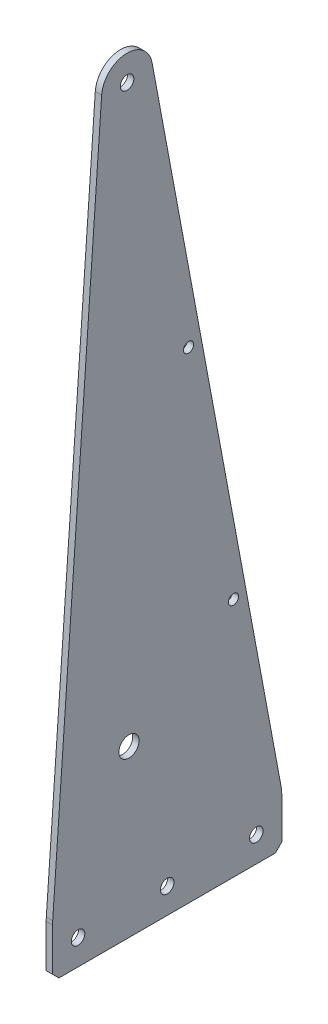
ISO-10303-21;
HEADER;
FILE_DESCRIPTION(('STEP AP214'),'2;1');
FILE_NAME('part.step','',(''),(''),'','','');
FILE_SCHEMA(('AUTOMOTIVE_DESIGN { 1 0 10303 214 1 1 1 1 }'));
ENDSEC;
DATA;
#1=APPLICATION_CONTEXT('core data for automotive mechanical design processes');
#2=APPLICATION_PROTOCOL_DEFINITION('international standard','automotive_design',2000,#1);
#3=PRODUCT_CONTEXT('',#1,'mechanical');
#4=PRODUCT('Part','Part','',(#3));
#5=PRODUCT_RELATED_PRODUCT_CATEGORY('part','',(#4));
#6=PRODUCT_DEFINITION_FORMATION('','',#4);
#7=PRODUCT_DEFINITION_CONTEXT('part definition',#1,'design');
#8=PRODUCT_DEFINITION('design','',#6,#7);
#9=PRODUCT_DEFINITION_SHAPE('','',#8);
#10=(LENGTH_UNIT() NAMED_UNIT(*) SI_UNIT(.MILLI.,.METRE.));
#11=(NAMED_UNIT(*) PLANE_ANGLE_UNIT() SI_UNIT($,.RADIAN.));
#12=(NAMED_UNIT(*) SI_UNIT($,.STERADIAN.) SOLID_ANGLE_UNIT());
#13=UNCERTAINTY_MEASURE_WITH_UNIT(LENGTH_MEASURE(1.E-05),#10,'distance_accuracy_value','');
#14=(GEOMETRIC_REPRESENTATION_CONTEXT(3) GLOBAL_UNCERTAINTY_ASSIGNED_CONTEXT((#13)) GLOBAL_UNIT_ASSIGNED_CONTEXT((#10,
#11,#12)) REPRESENTATION_CONTEXT('',''));
#15=CARTESIAN_POINT('',(0.,0.,0.));
#16=DIRECTION('',(0.,0.,1.));
#17=DIRECTION('',(1.,0.,0.));
#18=AXIS2_PLACEMENT_3D('',#15,#16,#17);
#19=CARTESIAN_POINT('',(3.175,369.653378232905,-62.540399951214));
#20=DIRECTION('',(1.,0.,0.));
#21=DIRECTION('',(0.,0.,-1.));
#22=AXIS2_PLACEMENT_3D('',#19,#20,#21);
#23=PLANE('',#22);
#24=CARTESIAN_POINT('',(3.175,12.7,-38.1));
#25=DIRECTION('',(1.,0.,0.));
#26=DIRECTION('',(0.,0.,-1.));
#27=AXIS2_PLACEMENT_3D('',#24,#25,#26);
#28=CIRCLE('',#27,3.3782);
#29=CARTESIAN_POINT('',(3.175,12.7,-41.4782));
#30=VERTEX_POINT('',#29);
#31=EDGE_CURVE('E305',#30,#30,#28,.T.);
#32=ORIENTED_EDGE('',*,*,#31,.F.);
#33=EDGE_LOOP('',(#32));
#34=FACE_BOUND('',#33,.T.);
#35=CARTESIAN_POINT('',(3.175,12.7,-82.55));
#36=DIRECTION('',(1.,0.,0.));
#37=DIRECTION('',(0.,0.,-1.));
#38=AXIS2_PLACEMENT_3D('',#35,#36,#37);
#39=CIRCLE('',#38,3.37819999999999);
#40=CARTESIAN_POINT('',(3.175,12.7,-85.9282));
#41=VERTEX_POINT('',#40);
#42=EDGE_CURVE('E298',#41,#41,#39,.T.);
#43=ORIENTED_EDGE('',*,*,#42,.F.);
#44=EDGE_LOOP('',(#43));
#45=FACE_BOUND('',#44,.T.);
#46=CARTESIAN_POINT('',(3.175,12.7,-127.));
#47=DIRECTION('',(1.,0.,0.));
#48=DIRECTION('',(0.,0.,-1.));
#49=AXIS2_PLACEMENT_3D('',#46,#47,#48);
#50=CIRCLE('',#49,3.37819999999999);
#51=CARTESIAN_POINT('',(3.175,12.7,-130.3782));
#52=VERTEX_POINT('',#51);
#53=EDGE_CURVE('E290',#52,#52,#50,.T.);
#54=ORIENTED_EDGE('',*,*,#53,.F.);
#55=EDGE_LOOP('',(#54));
#56=FACE_BOUND('',#55,.T.);
#57=CARTESIAN_POINT('',(3.175,240.00422977756,-93.1935590721841));
#58=DIRECTION('',(1.,0.,0.));
#59=DIRECTION('',(0.,0.,-1.));
#60=AXIS2_PLACEMENT_3D('',#57,#58,#59);
#61=CIRCLE('',#60,2.54000000000001);
#62=CARTESIAN_POINT('',(3.175,240.00422977756,-95.7335590721841));
#63=VERTEX_POINT('',#62);
#64=EDGE_CURVE('E282',#63,#63,#61,.T.);
#65=ORIENTED_EDGE('',*,*,#64,.F.);
#66=EDGE_LOOP('',(#65));
#67=FACE_BOUND('',#66,.T.);
#68=CARTESIAN_POINT('',(3.175,120.00211488878,-115.586891114724));
#69=DIRECTION('',(1.,0.,0.));
#70=DIRECTION('',(0.,0.,-1.));
#71=AXIS2_PLACEMENT_3D('',#68,#69,#70);
#72=CIRCLE('',#71,2.53999999999998);
#73=CARTESIAN_POINT('',(3.175,120.00211488878,-118.126891114724));
#74=VERTEX_POINT('',#73);
#75=EDGE_CURVE('E276',#74,#74,#72,.T.);
#76=ORIENTED_EDGE('',*,*,#75,.F.);
#77=EDGE_LOOP('',(#76));
#78=FACE_BOUND('',#77,.T.);
#79=CARTESIAN_POINT('',(3.175,82.55,-63.5));
#80=DIRECTION('',(1.,0.,0.));
#81=DIRECTION('',(0.,0.,-1.));
#82=AXIS2_PLACEMENT_3D('',#79,#80,#81);
#83=CIRCLE('',#82,5.0419);
#84=CARTESIAN_POINT('',(3.175,82.55,-68.5419));
#85=VERTEX_POINT('',#84);
#86=EDGE_CURVE('E176',#85,#85,#83,.T.);
#87=ORIENTED_EDGE('',*,*,#86,.F.);
#88=EDGE_LOOP('',(#87));
#89=FACE_BOUND('',#88,.T.);
#90=DIRECTION('',(0.,1.,0.));
#91=VECTOR('',#90,1.);
#92=CARTESIAN_POINT('',(3.175,0.,-139.7));
#93=LINE('',#92,#91);
#94=CARTESIAN_POINT('',(3.175,3.17500000000004,-139.7));
#95=VERTEX_POINT('',#94);
#96=CARTESIAN_POINT('',(3.175,23.0503608168832,-139.7));
#97=VERTEX_POINT('',#96);
#98=EDGE_CURVE('E148',#95,#97,#93,.T.);
#99=ORIENTED_EDGE('',*,*,#98,.T.);
#100=CARTESIAN_POINT('',(3.175,23.0503608168832,-114.3));
#101=DIRECTION('',(1.,0.,0.));
#102=DIRECTION('',(0.,0.,-1.));
#103=AXIS2_PLACEMENT_3D('',#100,#101,#102);
#104=CIRCLE('',#103,25.4);
#105=CARTESIAN_POINT('',(3.175,27.7097674118935,-139.268979358043));
#106=VERTEX_POINT('',#105);
#107=EDGE_CURVE('E143',#97,#106,#104,.T.);
#108=ORIENTED_EDGE('',*,*,#107,.T.);
#109=DIRECTION('',(0.,0.983030683387517,0.183441204527966));
#110=VECTOR('',#109,1.);
#111=CARTESIAN_POINT('',(3.175,25.4,-139.7));
#112=LINE('',#111,#110);
#113=CARTESIAN_POINT('',(3.175,371.98308153041,-75.0248896302355));
#114=VERTEX_POINT('',#113);
#115=EDGE_CURVE('E135',#106,#114,#112,.T.);
#116=ORIENTED_EDGE('',*,*,#115,.T.);
#117=CARTESIAN_POINT('',(3.175,369.653378232905,-62.540399951214));
#118=DIRECTION('',(1.,0.,0.));
#119=DIRECTION('',(0.,0.,-1.));
#120=AXIS2_PLACEMENT_3D('',#117,#118,#119);
#121=CIRCLE('',#120,12.7);
#122=CARTESIAN_POINT('',(3.175,370.551588468152,-49.8722028271835));
#123=VERTEX_POINT('',#122);
#124=EDGE_CURVE('E140',#114,#123,#121,.T.);
#125=ORIENTED_EDGE('',*,*,#124,.T.);
#126=DIRECTION('',(0.,-0.997495836537841,0.0707252153738169));
#127=VECTOR('',#126,1.);
#128=CARTESIAN_POINT('',(3.175,25.4,-25.4));
#129=LINE('',#128,#127);
#130=CARTESIAN_POINT('',(3.175,26.297084192724,-25.4636057519388));
#131=VERTEX_POINT('',#130);
#132=EDGE_CURVE('E162',#123,#131,#129,.T.);
#133=ORIENTED_EDGE('',*,*,#132,.T.);
#134=CARTESIAN_POINT('',(3.175,24.500663722229,-50.8));
#135=DIRECTION('',(1.,0.,0.));
#136=DIRECTION('',(0.,0.,-1.));
#137=AXIS2_PLACEMENT_3D('',#134,#135,#136);
#138=CIRCLE('',#137,25.4);
#139=CARTESIAN_POINT('',(3.175,24.500663722229,-25.4));
#140=VERTEX_POINT('',#139);
#141=EDGE_CURVE('E69',#131,#140,#138,.T.);
#142=ORIENTED_EDGE('',*,*,#141,.T.);
#143=DIRECTION('',(0.,-1.,0.));
#144=VECTOR('',#143,1.);
#145=CARTESIAN_POINT('',(3.175,0.,-25.4));
#146=LINE('',#145,#144);
#147=CARTESIAN_POINT('',(3.175,3.17500000000004,-25.4));
#148=VERTEX_POINT('',#147);
#149=EDGE_CURVE('E165',#140,#148,#146,.T.);
#150=ORIENTED_EDGE('',*,*,#149,.T.);
#151=DIRECTION('',(0.,0.707106781186548,0.707106781186548));
#152=VECTOR('',#151,1.);
#153=CARTESIAN_POINT('',(3.175,167.843989140845,139.268989140845));
#154=LINE('',#153,#152);
#155=CARTESIAN_POINT('',(3.175,0.,-28.575));
#156=VERTEX_POINT('',#155);
#157=EDGE_CURVE('E212',#148,#156,#154,.F.);
#158=ORIENTED_EDGE('',*,*,#157,.T.);
#159=DIRECTION('',(0.,0.,-1.));
#160=VECTOR('',#159,1.);
#161=CARTESIAN_POINT('',(3.175,0.,-25.4));
#162=LINE('',#161,#160);
#163=CARTESIAN_POINT('',(3.175,0.,-136.525));
#164=VERTEX_POINT('',#163);
#165=EDGE_CURVE('E190',#156,#164,#162,.T.);
#166=ORIENTED_EDGE('',*,*,#165,.T.);
#167=DIRECTION('',(0.,-0.707106781186541,0.707106781186554));
#168=VECTOR('',#167,1.);
#169=CARTESIAN_POINT('',(3.175,147.834389092056,-284.359389092059));
#170=LINE('',#169,#168);
#171=EDGE_CURVE('E209',#164,#95,#170,.F.);
#172=ORIENTED_EDGE('',*,*,#171,.T.);
#173=EDGE_LOOP('',(#99,#108,#116,#125,#133,#142,#150,#158,#166,#172));
#174=FACE_BOUND('',#173,.T.);
#175=CARTESIAN_POINT('',(3.175,369.653378232905,-62.540399951214));
#176=DIRECTION('',(1.,0.,0.));
#177=DIRECTION('',(0.,0.,-1.));
#178=AXIS2_PLACEMENT_3D('',#175,#176,#177);
#179=CIRCLE('',#178,3.37819999999999);
#180=CARTESIAN_POINT('',(3.175,369.653378232905,-65.918599951214));
#181=VERTEX_POINT('',#180);
#182=EDGE_CURVE('E267',#181,#181,#179,.T.);
#183=ORIENTED_EDGE('',*,*,#182,.F.);
#184=EDGE_LOOP('',(#183));
#185=FACE_BOUND('',#184,.T.);
#186=ADVANCED_FACE('F43',(#34,#45,#56,#67,#78,#89,#174,#185),#23,.T.);
#187=CARTESIAN_POINT('',(0.,369.653378232905,-62.540399951214));
#188=DIRECTION('',(1.,0.,0.));
#189=DIRECTION('',(0.,0.,-1.));
#190=AXIS2_PLACEMENT_3D('',#187,#188,#189);
#191=PLANE('',#190);
#192=CARTESIAN_POINT('',(0.,12.7,-38.1));
#193=DIRECTION('',(1.,0.,0.));
#194=DIRECTION('',(0.,0.,-1.));
#195=AXIS2_PLACEMENT_3D('',#192,#193,#194);
#196=CIRCLE('',#195,3.3782);
#197=CARTESIAN_POINT('',(0.,12.7,-41.4782));
#198=VERTEX_POINT('',#197);
#199=EDGE_CURVE('E273',#198,#198,#196,.T.);
#200=ORIENTED_EDGE('',*,*,#199,.T.);
#201=EDGE_LOOP('',(#200));
#202=FACE_BOUND('',#201,.T.);
#203=CARTESIAN_POINT('',(0.,12.7,-82.55));
#204=DIRECTION('',(1.,0.,0.));
#205=DIRECTION('',(0.,0.,-1.));
#206=AXIS2_PLACEMENT_3D('',#203,#204,#205);
#207=CIRCLE('',#206,3.37819999999999);
#208=CARTESIAN_POINT('',(0.,12.7,-85.9282));
#209=VERTEX_POINT('',#208);
#210=EDGE_CURVE('E302',#209,#209,#207,.T.);
#211=ORIENTED_EDGE('',*,*,#210,.T.);
#212=EDGE_LOOP('',(#211));
#213=FACE_BOUND('',#212,.T.);
#214=CARTESIAN_POINT('',(0.,12.7,-127.));
#215=DIRECTION('',(1.,0.,0.));
#216=DIRECTION('',(0.,0.,-1.));
#217=AXIS2_PLACEMENT_3D('',#214,#215,#216);
#218=CIRCLE('',#217,3.37819999999999);
#219=CARTESIAN_POINT('',(0.,12.7,-130.3782));
#220=VERTEX_POINT('',#219);
#221=EDGE_CURVE('E294',#220,#220,#218,.T.);
#222=ORIENTED_EDGE('',*,*,#221,.T.);
#223=EDGE_LOOP('',(#222));
#224=FACE_BOUND('',#223,.T.);
#225=CARTESIAN_POINT('',(0.,240.00422977756,-93.1935590721841));
#226=DIRECTION('',(1.,0.,0.));
#227=DIRECTION('',(0.,0.,-1.));
#228=AXIS2_PLACEMENT_3D('',#225,#226,#227);
#229=CIRCLE('',#228,2.54000000000001);
#230=CARTESIAN_POINT('',(0.,240.00422977756,-95.7335590721841));
#231=VERTEX_POINT('',#230);
#232=EDGE_CURVE('E286',#231,#231,#229,.T.);
#233=ORIENTED_EDGE('',*,*,#232,.T.);
#234=EDGE_LOOP('',(#233));
#235=FACE_BOUND('',#234,.T.);
#236=CARTESIAN_POINT('',(0.,120.00211488878,-115.586891114724));
#237=DIRECTION('',(1.,0.,0.));
#238=DIRECTION('',(0.,0.,-1.));
#239=AXIS2_PLACEMENT_3D('',#236,#237,#238);
#240=CIRCLE('',#239,2.53999999999998);
#241=CARTESIAN_POINT('',(0.,120.00211488878,-118.126891114724));
#242=VERTEX_POINT('',#241);
#243=EDGE_CURVE('E279',#242,#242,#240,.T.);
#244=ORIENTED_EDGE('',*,*,#243,.T.);
#245=EDGE_LOOP('',(#244));
#246=FACE_BOUND('',#245,.T.);
#247=DIRECTION('',(0.,0.983030683387517,0.183441204527966));
#248=VECTOR('',#247,1.);
#249=CARTESIAN_POINT('',(0.,25.4,-139.7));
#250=LINE('',#249,#248);
#251=CARTESIAN_POINT('',(0.,27.7097674118935,-139.268979358043));
#252=VERTEX_POINT('',#251);
#253=CARTESIAN_POINT('',(0.,371.98308153041,-75.0248896302355));
#254=VERTEX_POINT('',#253);
#255=EDGE_CURVE('E154',#252,#254,#250,.T.);
#256=ORIENTED_EDGE('',*,*,#255,.F.);
#257=CARTESIAN_POINT('',(0.,23.0503608168832,-114.3));
#258=DIRECTION('',(1.,0.,0.));
#259=DIRECTION('',(0.,0.,-1.));
#260=AXIS2_PLACEMENT_3D('',#257,#258,#259);
#261=CIRCLE('',#260,25.4);
#262=CARTESIAN_POINT('',(0.,23.0503608168832,-139.7));
#263=VERTEX_POINT('',#262);
#264=EDGE_CURVE('E225',#252,#263,#261,.F.);
#265=ORIENTED_EDGE('',*,*,#264,.T.);
#266=DIRECTION('',(0.,1.,0.));
#267=VECTOR('',#266,1.);
#268=CARTESIAN_POINT('',(0.,0.,-139.7));
#269=LINE('',#268,#267);
#270=CARTESIAN_POINT('',(0.,3.17500000000004,-139.7));
#271=VERTEX_POINT('',#270);
#272=EDGE_CURVE('E175',#271,#263,#269,.T.);
#273=ORIENTED_EDGE('',*,*,#272,.F.);
#274=DIRECTION('',(0.,0.707106781186541,-0.707106781186554));
#275=VECTOR('',#274,1.);
#276=CARTESIAN_POINT('',(0.,3.17500000000004,-139.7));
#277=LINE('',#276,#275);
#278=CARTESIAN_POINT('',(0.,0.,-136.525));
#279=VERTEX_POINT('',#278);
#280=EDGE_CURVE('E198',#271,#279,#277,.F.);
#281=ORIENTED_EDGE('',*,*,#280,.T.);
#282=DIRECTION('',(0.,0.,-1.));
#283=VECTOR('',#282,1.);
#284=CARTESIAN_POINT('',(0.,0.,-25.4));
#285=LINE('',#284,#283);
#286=CARTESIAN_POINT('',(0.,0.,-28.575));
#287=VERTEX_POINT('',#286);
#288=EDGE_CURVE('E171',#287,#279,#285,.T.);
#289=ORIENTED_EDGE('',*,*,#288,.F.);
#290=DIRECTION('',(0.,-0.707106781186548,-0.707106781186548));
#291=VECTOR('',#290,1.);
#292=CARTESIAN_POINT('',(0.,0.,-28.575));
#293=LINE('',#292,#291);
#294=CARTESIAN_POINT('',(0.,3.17500000000004,-25.4));
#295=VERTEX_POINT('',#294);
#296=EDGE_CURVE('E201',#287,#295,#293,.F.);
#297=ORIENTED_EDGE('',*,*,#296,.T.);
#298=DIRECTION('',(0.,-1.,0.));
#299=VECTOR('',#298,1.);
#300=CARTESIAN_POINT('',(0.,0.,-25.4));
#301=LINE('',#300,#299);
#302=CARTESIAN_POINT('',(0.,24.500663722229,-25.4));
#303=VERTEX_POINT('',#302);
#304=EDGE_CURVE('E187',#303,#295,#301,.T.);
#305=ORIENTED_EDGE('',*,*,#304,.F.);
#306=CARTESIAN_POINT('',(0.,24.500663722229,-50.8));
#307=DIRECTION('',(1.,0.,0.));
#308=DIRECTION('',(0.,0.,-1.));
#309=AXIS2_PLACEMENT_3D('',#306,#307,#308);
#310=CIRCLE('',#309,25.4);
#311=CARTESIAN_POINT('',(0.,26.297084192724,-25.4636057519388));
#312=VERTEX_POINT('',#311);
#313=EDGE_CURVE('E222',#303,#312,#310,.F.);
#314=ORIENTED_EDGE('',*,*,#313,.T.);
#315=DIRECTION('',(0.,-0.997495836537841,0.0707252153738169));
#316=VECTOR('',#315,1.);
#317=CARTESIAN_POINT('',(0.,25.4,-25.4));
#318=LINE('',#317,#316);
#319=CARTESIAN_POINT('',(0.,370.551588468152,-49.8722028271835));
#320=VERTEX_POINT('',#319);
#321=EDGE_CURVE('E184',#320,#312,#318,.T.);
#322=ORIENTED_EDGE('',*,*,#321,.F.);
#323=CARTESIAN_POINT('',(0.,369.653378232905,-62.540399951214));
#324=DIRECTION('',(1.,0.,0.));
#325=DIRECTION('',(0.,0.,-1.));
#326=AXIS2_PLACEMENT_3D('',#323,#324,#325);
#327=CIRCLE('',#326,12.7);
#328=EDGE_CURVE('E182',#254,#320,#327,.T.);
#329=ORIENTED_EDGE('',*,*,#328,.F.);
#330=EDGE_LOOP('',(#256,#265,#273,#281,#289,#297,#305,#314,#322,#329));
#331=FACE_BOUND('',#330,.T.);
#332=CARTESIAN_POINT('',(0.,82.55,-63.5));
#333=DIRECTION('',(1.,0.,0.));
#334=DIRECTION('',(0.,0.,-1.));
#335=AXIS2_PLACEMENT_3D('',#332,#333,#334);
#336=CIRCLE('',#335,5.0419);
#337=CARTESIAN_POINT('',(0.,82.55,-68.5419));
#338=VERTEX_POINT('',#337);
#339=EDGE_CURVE('E263',#338,#338,#336,.T.);
#340=ORIENTED_EDGE('',*,*,#339,.T.);
#341=EDGE_LOOP('',(#340));
#342=FACE_BOUND('',#341,.T.);
#343=CARTESIAN_POINT('',(0.,369.653378232905,-62.540399951214));
#344=DIRECTION('',(1.,0.,0.));
#345=DIRECTION('',(0.,0.,-1.));
#346=AXIS2_PLACEMENT_3D('',#343,#344,#345);
#347=CIRCLE('',#346,3.37819999999999);
#348=CARTESIAN_POINT('',(0.,369.653378232905,-65.918599951214));
#349=VERTEX_POINT('',#348);
#350=EDGE_CURVE('E270',#349,#349,#347,.T.);
#351=ORIENTED_EDGE('',*,*,#350,.T.);
#352=EDGE_LOOP('',(#351));
#353=FACE_BOUND('',#352,.T.);
#354=ADVANCED_FACE('F243',(#202,#213,#224,#235,#246,#331,#342,#353),#191,.F.);
#355=CARTESIAN_POINT('',(3.175,0.,-25.4));
#356=DIRECTION('',(0.,1.,0.));
#357=DIRECTION('',(0.,0.,1.));
#358=AXIS2_PLACEMENT_3D('',#355,#356,#357);
#359=PLANE('',#358);
#360=ORIENTED_EDGE('',*,*,#165,.F.);
#361=DIRECTION('',(-1.,0.,0.));
#362=VECTOR('',#361,1.);
#363=CARTESIAN_POINT('',(3.175,0.,-28.575));
#364=LINE('',#363,#362);
#365=EDGE_CURVE('E194',#156,#287,#364,.T.);
#366=ORIENTED_EDGE('',*,*,#365,.T.);
#367=ORIENTED_EDGE('',*,*,#288,.T.);
#368=DIRECTION('',(1.,0.,0.));
#369=VECTOR('',#368,1.);
#370=CARTESIAN_POINT('',(3.175,0.,-136.525));
#371=LINE('',#370,#369);
#372=EDGE_CURVE('E157',#279,#164,#371,.T.);
#373=ORIENTED_EDGE('',*,*,#372,.T.);
#374=EDGE_LOOP('',(#360,#366,#367,#373));
#375=FACE_BOUND('',#374,.T.);
#376=ADVANCED_FACE('F256',(#375),#359,.F.);
#377=CARTESIAN_POINT('',(3.175,0.,-139.7));
#378=DIRECTION('',(0.,0.,1.));
#379=DIRECTION('',(1.,0.,0.));
#380=AXIS2_PLACEMENT_3D('',#377,#378,#379);
#381=PLANE('',#380);
#382=ORIENTED_EDGE('',*,*,#272,.T.);
#383=DIRECTION('',(-1.,0.,0.));
#384=VECTOR('',#383,1.);
#385=CARTESIAN_POINT('',(3.175,23.0503608168832,-139.7));
#386=LINE('',#385,#384);
#387=EDGE_CURVE('E228',#263,#97,#386,.F.);
#388=ORIENTED_EDGE('',*,*,#387,.T.);
#389=ORIENTED_EDGE('',*,*,#98,.F.);
#390=DIRECTION('',(-1.,0.,0.));
#391=VECTOR('',#390,1.);
#392=CARTESIAN_POINT('',(3.175,3.17500000000004,-139.7));
#393=LINE('',#392,#391);
#394=EDGE_CURVE('E215',#95,#271,#393,.T.);
#395=ORIENTED_EDGE('',*,*,#394,.T.);
#396=EDGE_LOOP('',(#382,#388,#389,#395));
#397=FACE_BOUND('',#396,.T.);
#398=ADVANCED_FACE('F367',(#397),#381,.F.);
#399=CARTESIAN_POINT('',(3.175,25.4,-139.7));
#400=DIRECTION('',(0.,-0.183441204527966,0.983030683387517));
#401=DIRECTION('',(0.,-0.983030683387517,-0.183441204527966));
#402=AXIS2_PLACEMENT_3D('',#399,#400,#401);
#403=PLANE('',#402);
#404=ORIENTED_EDGE('',*,*,#115,.F.);
#405=DIRECTION('',(-1.,0.,0.));
#406=VECTOR('',#405,1.);
#407=CARTESIAN_POINT('',(3.175,27.7097674118935,-139.268979358043));
#408=LINE('',#407,#406);
#409=EDGE_CURVE('E219',#106,#252,#408,.T.);
#410=ORIENTED_EDGE('',*,*,#409,.T.);
#411=ORIENTED_EDGE('',*,*,#255,.T.);
#412=DIRECTION('',(-1.,0.,0.));
#413=VECTOR('',#412,1.);
#414=CARTESIAN_POINT('',(3.175,371.98308153041,-75.0248896302355));
#415=LINE('',#414,#413);
#416=EDGE_CURVE('E151',#114,#254,#415,.T.);
#417=ORIENTED_EDGE('',*,*,#416,.F.);
#418=EDGE_LOOP('',(#404,#410,#411,#417));
#419=FACE_BOUND('',#418,.T.);
#420=ADVANCED_FACE('F152',(#419),#403,.F.);
#421=CARTESIAN_POINT('',(3.175,369.653378232905,-62.540399951214));
#422=DIRECTION('',(-1.,0.,0.));
#423=DIRECTION('',(0.,0.,1.));
#424=AXIS2_PLACEMENT_3D('',#421,#422,#423);
#425=CYLINDRICAL_SURFACE('',#424,12.7);
#426=ORIENTED_EDGE('',*,*,#328,.T.);
#427=DIRECTION('',(-1.,0.,0.));
#428=VECTOR('',#427,1.);
#429=CARTESIAN_POINT('',(3.175,370.551588468152,-49.8722028271835));
#430=LINE('',#429,#428);
#431=EDGE_CURVE('E158',#123,#320,#430,.T.);
#432=ORIENTED_EDGE('',*,*,#431,.F.);
#433=ORIENTED_EDGE('',*,*,#124,.F.);
#434=ORIENTED_EDGE('',*,*,#416,.T.);
#435=EDGE_LOOP('',(#426,#432,#433,#434));
#436=FACE_BOUND('',#435,.T.);
#437=ADVANCED_FACE('F160',(#436),#425,.T.);
#438=CARTESIAN_POINT('',(3.175,25.4,-25.4));
#439=DIRECTION('',(0.,-0.0707252153738169,-0.997495836537841));
#440=DIRECTION('',(0.,0.997495836537841,-0.0707252153738169));
#441=AXIS2_PLACEMENT_3D('',#438,#439,#440);
#442=PLANE('',#441);
#443=ORIENTED_EDGE('',*,*,#321,.T.);
#444=DIRECTION('',(-1.,0.,0.));
#445=VECTOR('',#444,1.);
#446=CARTESIAN_POINT('',(3.175,26.297084192724,-25.4636057519388));
#447=LINE('',#446,#445);
#448=EDGE_CURVE('E11',#312,#131,#447,.F.);
#449=ORIENTED_EDGE('',*,*,#448,.T.);
#450=ORIENTED_EDGE('',*,*,#132,.F.);
#451=ORIENTED_EDGE('',*,*,#431,.T.);
#452=EDGE_LOOP('',(#443,#449,#450,#451));
#453=FACE_BOUND('',#452,.T.);
#454=ADVANCED_FACE('F360',(#453),#442,.F.);
#455=CARTESIAN_POINT('',(3.175,0.,-25.4));
#456=DIRECTION('',(0.,0.,-1.));
#457=DIRECTION('',(-1.,0.,0.));
#458=AXIS2_PLACEMENT_3D('',#455,#456,#457);
#459=PLANE('',#458);
#460=ORIENTED_EDGE('',*,*,#149,.F.);
#461=DIRECTION('',(-1.,0.,0.));
#462=VECTOR('',#461,1.);
#463=CARTESIAN_POINT('',(3.175,24.500663722229,-25.4));
#464=LINE('',#463,#462);
#465=EDGE_CURVE('E52',#140,#303,#464,.T.);
#466=ORIENTED_EDGE('',*,*,#465,.T.);
#467=ORIENTED_EDGE('',*,*,#304,.T.);
#468=DIRECTION('',(1.,0.,0.));
#469=VECTOR('',#468,1.);
#470=CARTESIAN_POINT('',(3.175,3.17500000000004,-25.4));
#471=LINE('',#470,#469);
#472=EDGE_CURVE('E205',#295,#148,#471,.T.);
#473=ORIENTED_EDGE('',*,*,#472,.T.);
#474=EDGE_LOOP('',(#460,#466,#467,#473));
#475=FACE_BOUND('',#474,.T.);
#476=ADVANCED_FACE('F240',(#475),#459,.F.);
#477=CARTESIAN_POINT('',(3.175,82.55,-63.5));
#478=DIRECTION('',(-1.,0.,0.));
#479=DIRECTION('',(0.,0.,1.));
#480=AXIS2_PLACEMENT_3D('',#477,#478,#479);
#481=CYLINDRICAL_SURFACE('',#480,5.0419);
#482=ORIENTED_EDGE('',*,*,#86,.T.);
#483=EDGE_LOOP('',(#482));
#484=FACE_BOUND('',#483,.T.);
#485=ORIENTED_EDGE('',*,*,#339,.F.);
#486=EDGE_LOOP('',(#485));
#487=FACE_BOUND('',#486,.T.);
#488=ADVANCED_FACE('F335',(#484,#487),#481,.F.);
#489=CARTESIAN_POINT('',(3.175,369.653378232905,-62.540399951214));
#490=DIRECTION('',(-1.,0.,0.));
#491=DIRECTION('',(0.,0.,1.));
#492=AXIS2_PLACEMENT_3D('',#489,#490,#491);
#493=CYLINDRICAL_SURFACE('',#492,3.37819999999999);
#494=ORIENTED_EDGE('',*,*,#182,.T.);
#495=EDGE_LOOP('',(#494));
#496=FACE_BOUND('',#495,.T.);
#497=ORIENTED_EDGE('',*,*,#350,.F.);
#498=EDGE_LOOP('',(#497));
#499=FACE_BOUND('',#498,.T.);
#500=ADVANCED_FACE('F338',(#496,#499),#493,.F.);
#501=CARTESIAN_POINT('',(0.,120.00211488878,-115.586891114724));
#502=DIRECTION('',(1.,0.,0.));
#503=DIRECTION('',(0.,0.,-1.));
#504=AXIS2_PLACEMENT_3D('',#501,#502,#503);
#505=CYLINDRICAL_SURFACE('',#504,2.53999999999998);
#506=ORIENTED_EDGE('',*,*,#243,.F.);
#507=EDGE_LOOP('',(#506));
#508=FACE_BOUND('',#507,.T.);
#509=ORIENTED_EDGE('',*,*,#75,.T.);
#510=EDGE_LOOP('',(#509));
#511=FACE_BOUND('',#510,.T.);
#512=ADVANCED_FACE('F347',(#508,#511),#505,.F.);
#513=CARTESIAN_POINT('',(0.,240.00422977756,-93.1935590721841));
#514=DIRECTION('',(1.,0.,0.));
#515=DIRECTION('',(0.,0.,-1.));
#516=AXIS2_PLACEMENT_3D('',#513,#514,#515);
#517=CYLINDRICAL_SURFACE('',#516,2.54000000000001);
#518=ORIENTED_EDGE('',*,*,#232,.F.);
#519=EDGE_LOOP('',(#518));
#520=FACE_BOUND('',#519,.T.);
#521=ORIENTED_EDGE('',*,*,#64,.T.);
#522=EDGE_LOOP('',(#521));
#523=FACE_BOUND('',#522,.T.);
#524=ADVANCED_FACE('F353',(#520,#523),#517,.F.);
#525=CARTESIAN_POINT('',(0.,12.7,-127.));
#526=DIRECTION('',(1.,0.,0.));
#527=DIRECTION('',(0.,0.,-1.));
#528=AXIS2_PLACEMENT_3D('',#525,#526,#527);
#529=CYLINDRICAL_SURFACE('',#528,3.37819999999999);
#530=ORIENTED_EDGE('',*,*,#221,.F.);
#531=EDGE_LOOP('',(#530));
#532=FACE_BOUND('',#531,.T.);
#533=ORIENTED_EDGE('',*,*,#53,.T.);
#534=EDGE_LOOP('',(#533));
#535=FACE_BOUND('',#534,.T.);
#536=ADVANCED_FACE('F471',(#532,#535),#529,.F.);
#537=CARTESIAN_POINT('',(0.,12.7,-82.55));
#538=DIRECTION('',(1.,0.,0.));
#539=DIRECTION('',(0.,0.,-1.));
#540=AXIS2_PLACEMENT_3D('',#537,#538,#539);
#541=CYLINDRICAL_SURFACE('',#540,3.37819999999999);
#542=ORIENTED_EDGE('',*,*,#210,.F.);
#543=EDGE_LOOP('',(#542));
#544=FACE_BOUND('',#543,.T.);
#545=ORIENTED_EDGE('',*,*,#42,.T.);
#546=EDGE_LOOP('',(#545));
#547=FACE_BOUND('',#546,.T.);
#548=ADVANCED_FACE('F318',(#544,#547),#541,.F.);
#549=CARTESIAN_POINT('',(0.,12.7,-38.1));
#550=DIRECTION('',(1.,0.,0.));
#551=DIRECTION('',(0.,0.,-1.));
#552=AXIS2_PLACEMENT_3D('',#549,#550,#551);
#553=CYLINDRICAL_SURFACE('',#552,3.3782);
#554=ORIENTED_EDGE('',*,*,#199,.F.);
#555=EDGE_LOOP('',(#554));
#556=FACE_BOUND('',#555,.T.);
#557=ORIENTED_EDGE('',*,*,#31,.T.);
#558=EDGE_LOOP('',(#557));
#559=FACE_BOUND('',#558,.T.);
#560=ADVANCED_FACE('F315',(#556,#559),#553,.F.);
#561=CARTESIAN_POINT('',(3.175,0.,-28.575));
#562=DIRECTION('',(0.,0.707106781186548,-0.707106781186548));
#563=DIRECTION('',(-1.,0.,0.));
#564=AXIS2_PLACEMENT_3D('',#561,#562,#563);
#565=PLANE('',#564);
#566=ORIENTED_EDGE('',*,*,#157,.F.);
#567=ORIENTED_EDGE('',*,*,#472,.F.);
#568=ORIENTED_EDGE('',*,*,#296,.F.);
#569=ORIENTED_EDGE('',*,*,#365,.F.);
#570=EDGE_LOOP('',(#566,#567,#568,#569));
#571=FACE_BOUND('',#570,.T.);
#572=ADVANCED_FACE('F251',(#571),#565,.F.);
#573=CARTESIAN_POINT('',(3.175,3.17500000000004,-139.7));
#574=DIRECTION('',(0.,0.707106781186554,0.707106781186541));
#575=DIRECTION('',(-1.,0.,0.));
#576=AXIS2_PLACEMENT_3D('',#573,#574,#575);
#577=PLANE('',#576);
#578=ORIENTED_EDGE('',*,*,#171,.F.);
#579=ORIENTED_EDGE('',*,*,#372,.F.);
#580=ORIENTED_EDGE('',*,*,#280,.F.);
#581=ORIENTED_EDGE('',*,*,#394,.F.);
#582=EDGE_LOOP('',(#578,#579,#580,#581));
#583=FACE_BOUND('',#582,.T.);
#584=ADVANCED_FACE('F379',(#583),#577,.F.);
#585=CARTESIAN_POINT('',(3.175,23.0503608168832,-114.3));
#586=DIRECTION('',(-1.,0.,0.));
#587=DIRECTION('',(0.,0.,1.));
#588=AXIS2_PLACEMENT_3D('',#585,#586,#587);
#589=CYLINDRICAL_SURFACE('',#588,25.4);
#590=ORIENTED_EDGE('',*,*,#107,.F.);
#591=ORIENTED_EDGE('',*,*,#387,.F.);
#592=ORIENTED_EDGE('',*,*,#264,.F.);
#593=ORIENTED_EDGE('',*,*,#409,.F.);
#594=EDGE_LOOP('',(#590,#591,#592,#593));
#595=FACE_BOUND('',#594,.T.);
#596=ADVANCED_FACE('F383',(#595),#589,.T.);
#597=CARTESIAN_POINT('',(3.175,24.500663722229,-50.8));
#598=DIRECTION('',(-1.,0.,0.));
#599=DIRECTION('',(0.,0.,1.));
#600=AXIS2_PLACEMENT_3D('',#597,#598,#599);
#601=CYLINDRICAL_SURFACE('',#600,25.4);
#602=ORIENTED_EDGE('',*,*,#141,.F.);
#603=ORIENTED_EDGE('',*,*,#448,.F.);
#604=ORIENTED_EDGE('',*,*,#313,.F.);
#605=ORIENTED_EDGE('',*,*,#465,.F.);
#606=EDGE_LOOP('',(#602,#603,#604,#605));
#607=FACE_BOUND('',#606,.T.);
#608=ADVANCED_FACE('F45',(#607),#601,.T.);
#609=CLOSED_SHELL('',(#186,#354,#376,#398,#420,#437,#454,#476,#488,#500,#512,#524,#536,#548,
#560,#572,#584,#596,#608));
#610=MANIFOLD_SOLID_BREP('B2',#609);
#611=ADVANCED_BREP_SHAPE_REPRESENTATION('',(#18,#610),#14);
#612=SHAPE_DEFINITION_REPRESENTATION(#9,#611);
ENDSEC;
END-ISO-10303-21;
